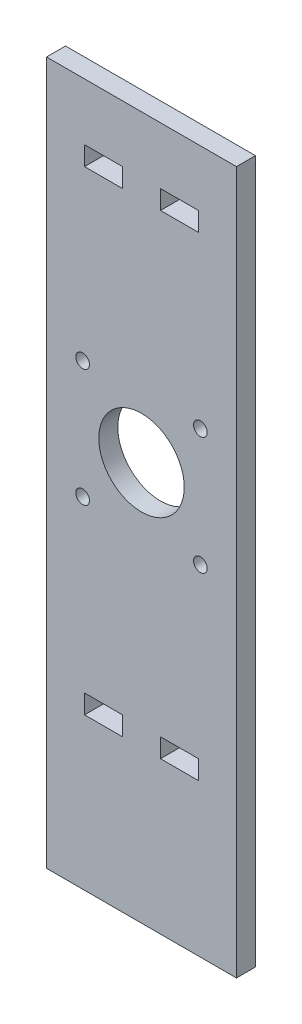
ISO-10303-21;
HEADER;
FILE_DESCRIPTION(('STEP AP214'),'2;1');
FILE_NAME('part.step','',(''),(''),'','','');
FILE_SCHEMA(('AUTOMOTIVE_DESIGN { 1 0 10303 214 1 1 1 1 }'));
ENDSEC;
DATA;
#1=APPLICATION_CONTEXT('core data for automotive mechanical design processes');
#2=APPLICATION_PROTOCOL_DEFINITION('international standard','automotive_design',2000,#1);
#3=PRODUCT_CONTEXT('',#1,'mechanical');
#4=PRODUCT('Part','Part','',(#3));
#5=PRODUCT_RELATED_PRODUCT_CATEGORY('part','',(#4));
#6=PRODUCT_DEFINITION_FORMATION('','',#4);
#7=PRODUCT_DEFINITION_CONTEXT('part definition',#1,'design');
#8=PRODUCT_DEFINITION('design','',#6,#7);
#9=PRODUCT_DEFINITION_SHAPE('','',#8);
#10=(LENGTH_UNIT() NAMED_UNIT(*) SI_UNIT(.MILLI.,.METRE.));
#11=(NAMED_UNIT(*) PLANE_ANGLE_UNIT() SI_UNIT($,.RADIAN.));
#12=(NAMED_UNIT(*) SI_UNIT($,.STERADIAN.) SOLID_ANGLE_UNIT());
#13=UNCERTAINTY_MEASURE_WITH_UNIT(LENGTH_MEASURE(1.E-05),#10,'distance_accuracy_value','');
#14=(GEOMETRIC_REPRESENTATION_CONTEXT(3) GLOBAL_UNCERTAINTY_ASSIGNED_CONTEXT((#13)) GLOBAL_UNIT_ASSIGNED_CONTEXT((#10,
#11,#12)) REPRESENTATION_CONTEXT('',''));
#15=CARTESIAN_POINT('',(0.,0.,0.));
#16=DIRECTION('',(0.,0.,1.));
#17=DIRECTION('',(1.,0.,0.));
#18=AXIS2_PLACEMENT_3D('',#15,#16,#17);
#19=CARTESIAN_POINT('',(0.,0.,5.));
#20=DIRECTION('',(0.,0.,-1.));
#21=DIRECTION('',(-1.,0.,0.));
#22=AXIS2_PLACEMENT_3D('',#19,#20,#21);
#23=PLANE('',#22);
#24=DIRECTION('',(-1.,0.,0.));
#25=VECTOR('',#24,1.);
#26=CARTESIAN_POINT('',(40.,45.,5.));
#27=LINE('',#26,#25);
#28=CARTESIAN_POINT('',(40.,45.,5.));
#29=VERTEX_POINT('',#28);
#30=CARTESIAN_POINT('',(30.,45.,5.));
#31=VERTEX_POINT('',#30);
#32=EDGE_CURVE('E209',#29,#31,#27,.T.);
#33=ORIENTED_EDGE('',*,*,#32,.F.);
#34=DIRECTION('',(0.,1.,0.));
#35=VECTOR('',#34,1.);
#36=CARTESIAN_POINT('',(40.,45.,5.));
#37=LINE('',#36,#35);
#38=CARTESIAN_POINT('',(40.,40.,5.));
#39=VERTEX_POINT('',#38);
#40=EDGE_CURVE('E217',#39,#29,#37,.T.);
#41=ORIENTED_EDGE('',*,*,#40,.F.);
#42=DIRECTION('',(1.,0.,0.));
#43=VECTOR('',#42,1.);
#44=CARTESIAN_POINT('',(40.,40.,5.));
#45=LINE('',#44,#43);
#46=CARTESIAN_POINT('',(30.,40.,5.));
#47=VERTEX_POINT('',#46);
#48=EDGE_CURVE('E214',#47,#39,#45,.T.);
#49=ORIENTED_EDGE('',*,*,#48,.F.);
#50=DIRECTION('',(0.,-1.,0.));
#51=VECTOR('',#50,1.);
#52=CARTESIAN_POINT('',(30.,45.,5.));
#53=LINE('',#52,#51);
#54=EDGE_CURVE('E211',#31,#47,#53,.T.);
#55=ORIENTED_EDGE('',*,*,#54,.F.);
#56=EDGE_LOOP('',(#33,#41,#49,#55));
#57=FACE_BOUND('',#56,.T.);
#58=DIRECTION('',(0.,-1.,0.));
#59=VECTOR('',#58,1.);
#60=CARTESIAN_POINT('',(10.,170.,5.));
#61=LINE('',#60,#59);
#62=CARTESIAN_POINT('',(10.,170.,5.));
#63=VERTEX_POINT('',#62);
#64=CARTESIAN_POINT('',(10.,165.,5.));
#65=VERTEX_POINT('',#64);
#66=EDGE_CURVE('E271',#63,#65,#61,.T.);
#67=ORIENTED_EDGE('',*,*,#66,.F.);
#68=DIRECTION('',(-1.,0.,0.));
#69=VECTOR('',#68,1.);
#70=CARTESIAN_POINT('',(10.,170.,5.));
#71=LINE('',#70,#69);
#72=CARTESIAN_POINT('',(20.,170.,5.));
#73=VERTEX_POINT('',#72);
#74=EDGE_CURVE('E279',#73,#63,#71,.T.);
#75=ORIENTED_EDGE('',*,*,#74,.F.);
#76=DIRECTION('',(0.,1.,0.));
#77=VECTOR('',#76,1.);
#78=CARTESIAN_POINT('',(20.,170.,5.));
#79=LINE('',#78,#77);
#80=CARTESIAN_POINT('',(20.,165.,5.));
#81=VERTEX_POINT('',#80);
#82=EDGE_CURVE('E276',#81,#73,#79,.T.);
#83=ORIENTED_EDGE('',*,*,#82,.F.);
#84=DIRECTION('',(1.,0.,0.));
#85=VECTOR('',#84,1.);
#86=CARTESIAN_POINT('',(10.,165.,5.));
#87=LINE('',#86,#85);
#88=EDGE_CURVE('E273',#65,#81,#87,.T.);
#89=ORIENTED_EDGE('',*,*,#88,.F.);
#90=EDGE_LOOP('',(#67,#75,#83,#89));
#91=FACE_BOUND('',#90,.T.);
#92=DIRECTION('',(0.,-1.,0.));
#93=VECTOR('',#92,1.);
#94=CARTESIAN_POINT('',(0.,0.,5.));
#95=LINE('',#94,#93);
#96=CARTESIAN_POINT('',(0.,185.,5.));
#97=VERTEX_POINT('',#96);
#98=CARTESIAN_POINT('',(0.,0.,5.));
#99=VERTEX_POINT('',#98);
#100=EDGE_CURVE('E302',#97,#99,#95,.T.);
#101=ORIENTED_EDGE('',*,*,#100,.T.);
#102=DIRECTION('',(1.,0.,0.));
#103=VECTOR('',#102,1.);
#104=CARTESIAN_POINT('',(0.,0.,5.));
#105=LINE('',#104,#103);
#106=CARTESIAN_POINT('',(50.,0.,5.));
#107=VERTEX_POINT('',#106);
#108=EDGE_CURVE('E305',#99,#107,#105,.T.);
#109=ORIENTED_EDGE('',*,*,#108,.T.);
#110=DIRECTION('',(0.,1.,0.));
#111=VECTOR('',#110,1.);
#112=CARTESIAN_POINT('',(50.,0.,5.));
#113=LINE('',#112,#111);
#114=CARTESIAN_POINT('',(50.,185.,5.));
#115=VERTEX_POINT('',#114);
#116=EDGE_CURVE('E308',#107,#115,#113,.T.);
#117=ORIENTED_EDGE('',*,*,#116,.T.);
#118=DIRECTION('',(-1.,0.,0.));
#119=VECTOR('',#118,1.);
#120=CARTESIAN_POINT('',(0.,185.,5.));
#121=LINE('',#120,#119);
#122=EDGE_CURVE('E310',#115,#97,#121,.T.);
#123=ORIENTED_EDGE('',*,*,#122,.T.);
#124=EDGE_LOOP('',(#101,#109,#117,#123));
#125=FACE_BOUND('',#124,.T.);
#126=DIRECTION('',(0.,-1.,0.));
#127=VECTOR('',#126,1.);
#128=CARTESIAN_POINT('',(10.,45.,5.));
#129=LINE('',#128,#127);
#130=CARTESIAN_POINT('',(10.,45.,5.));
#131=VERTEX_POINT('',#130);
#132=CARTESIAN_POINT('',(10.,40.,5.));
#133=VERTEX_POINT('',#132);
#134=EDGE_CURVE('E240',#131,#133,#129,.T.);
#135=ORIENTED_EDGE('',*,*,#134,.F.);
#136=DIRECTION('',(-1.,0.,0.));
#137=VECTOR('',#136,1.);
#138=CARTESIAN_POINT('',(10.,45.,5.));
#139=LINE('',#138,#137);
#140=CARTESIAN_POINT('',(20.,45.,5.));
#141=VERTEX_POINT('',#140);
#142=EDGE_CURVE('E248',#141,#131,#139,.T.);
#143=ORIENTED_EDGE('',*,*,#142,.F.);
#144=DIRECTION('',(0.,1.,0.));
#145=VECTOR('',#144,1.);
#146=CARTESIAN_POINT('',(20.,45.,5.));
#147=LINE('',#146,#145);
#148=CARTESIAN_POINT('',(20.,40.,5.));
#149=VERTEX_POINT('',#148);
#150=EDGE_CURVE('E245',#149,#141,#147,.T.);
#151=ORIENTED_EDGE('',*,*,#150,.F.);
#152=DIRECTION('',(1.,0.,0.));
#153=VECTOR('',#152,1.);
#154=CARTESIAN_POINT('',(10.,40.,5.));
#155=LINE('',#154,#153);
#156=EDGE_CURVE('E242',#133,#149,#155,.T.);
#157=ORIENTED_EDGE('',*,*,#156,.F.);
#158=EDGE_LOOP('',(#135,#143,#151,#157));
#159=FACE_BOUND('',#158,.T.);
#160=DIRECTION('',(-1.,0.,0.));
#161=VECTOR('',#160,1.);
#162=CARTESIAN_POINT('',(40.,170.,5.));
#163=LINE('',#162,#161);
#164=CARTESIAN_POINT('',(40.,170.,5.));
#165=VERTEX_POINT('',#164);
#166=CARTESIAN_POINT('',(30.,170.,5.));
#167=VERTEX_POINT('',#166);
#168=EDGE_CURVE('E170',#165,#167,#163,.T.);
#169=ORIENTED_EDGE('',*,*,#168,.F.);
#170=DIRECTION('',(0.,1.,0.));
#171=VECTOR('',#170,1.);
#172=CARTESIAN_POINT('',(40.,170.,5.));
#173=LINE('',#172,#171);
#174=CARTESIAN_POINT('',(40.,165.,5.));
#175=VERTEX_POINT('',#174);
#176=EDGE_CURVE('E193',#175,#165,#173,.T.);
#177=ORIENTED_EDGE('',*,*,#176,.F.);
#178=DIRECTION('',(1.,0.,0.));
#179=VECTOR('',#178,1.);
#180=CARTESIAN_POINT('',(40.,165.,5.));
#181=LINE('',#180,#179);
#182=CARTESIAN_POINT('',(30.,165.,5.));
#183=VERTEX_POINT('',#182);
#184=EDGE_CURVE('E191',#183,#175,#181,.T.);
#185=ORIENTED_EDGE('',*,*,#184,.F.);
#186=DIRECTION('',(0.,-1.,0.));
#187=VECTOR('',#186,1.);
#188=CARTESIAN_POINT('',(30.,170.,5.));
#189=LINE('',#188,#187);
#190=EDGE_CURVE('E178',#167,#183,#189,.T.);
#191=ORIENTED_EDGE('',*,*,#190,.F.);
#192=EDGE_LOOP('',(#169,#177,#185,#191));
#193=FACE_BOUND('',#192,.T.);
#194=CARTESIAN_POINT('',(25.,105.,5.));
#195=DIRECTION('',(0.,0.,1.));
#196=DIRECTION('',(1.,0.,0.));
#197=AXIS2_PLACEMENT_3D('',#194,#195,#196);
#198=CIRCLE('',#197,11.25);
#199=CARTESIAN_POINT('',(36.25,105.,5.));
#200=VERTEX_POINT('',#199);
#201=EDGE_CURVE('E199',#200,#200,#198,.T.);
#202=ORIENTED_EDGE('',*,*,#201,.F.);
#203=EDGE_LOOP('',(#202));
#204=FACE_BOUND('',#203,.T.);
#205=CARTESIAN_POINT('',(9.49999999999999,120.5,5.));
#206=DIRECTION('',(0.,0.,1.));
#207=DIRECTION('',(1.,0.,0.));
#208=AXIS2_PLACEMENT_3D('',#205,#206,#207);
#209=CIRCLE('',#208,1.8);
#210=CARTESIAN_POINT('',(11.3,120.5,5.));
#211=VERTEX_POINT('',#210);
#212=EDGE_CURVE('E486',#211,#211,#209,.T.);
#213=ORIENTED_EDGE('',*,*,#212,.F.);
#214=EDGE_LOOP('',(#213));
#215=FACE_BOUND('',#214,.T.);
#216=CARTESIAN_POINT('',(9.49999999999999,89.5,5.));
#217=DIRECTION('',(0.,0.,1.));
#218=DIRECTION('',(1.,0.,0.));
#219=AXIS2_PLACEMENT_3D('',#216,#217,#218);
#220=CIRCLE('',#219,1.8);
#221=CARTESIAN_POINT('',(11.3,89.5,5.));
#222=VERTEX_POINT('',#221);
#223=EDGE_CURVE('E480',#222,#222,#220,.T.);
#224=ORIENTED_EDGE('',*,*,#223,.F.);
#225=EDGE_LOOP('',(#224));
#226=FACE_BOUND('',#225,.T.);
#227=CARTESIAN_POINT('',(40.5,89.5,5.));
#228=DIRECTION('',(0.,0.,1.));
#229=DIRECTION('',(-1.,0.,0.));
#230=AXIS2_PLACEMENT_3D('',#227,#228,#229);
#231=CIRCLE('',#230,1.79999999999999);
#232=CARTESIAN_POINT('',(38.7,89.5,5.));
#233=VERTEX_POINT('',#232);
#234=EDGE_CURVE('E474',#233,#233,#231,.T.);
#235=ORIENTED_EDGE('',*,*,#234,.F.);
#236=EDGE_LOOP('',(#235));
#237=FACE_BOUND('',#236,.T.);
#238=CARTESIAN_POINT('',(40.5,120.5,5.));
#239=DIRECTION('',(0.,0.,1.));
#240=DIRECTION('',(-1.,0.,0.));
#241=AXIS2_PLACEMENT_3D('',#238,#239,#240);
#242=CIRCLE('',#241,1.79999999999999);
#243=CARTESIAN_POINT('',(38.7,120.5,5.));
#244=VERTEX_POINT('',#243);
#245=EDGE_CURVE('E465',#244,#244,#242,.T.);
#246=ORIENTED_EDGE('',*,*,#245,.F.);
#247=EDGE_LOOP('',(#246));
#248=FACE_BOUND('',#247,.T.);
#249=ADVANCED_FACE('F33',(#57,#91,#125,#159,#193,#204,#215,#226,#237,#248),#23,.F.);
#250=CARTESIAN_POINT('',(0.,0.,0.));
#251=DIRECTION('',(0.,0.,-1.));
#252=DIRECTION('',(-1.,0.,0.));
#253=AXIS2_PLACEMENT_3D('',#250,#251,#252);
#254=PLANE('',#253);
#255=CARTESIAN_POINT('',(40.5,89.5,0.));
#256=DIRECTION('',(0.,0.,1.));
#257=DIRECTION('',(-1.,0.,0.));
#258=AXIS2_PLACEMENT_3D('',#255,#256,#257);
#259=CIRCLE('',#258,1.79999999999999);
#260=CARTESIAN_POINT('',(38.7,89.5,0.));
#261=VERTEX_POINT('',#260);
#262=EDGE_CURVE('E471',#261,#261,#259,.T.);
#263=ORIENTED_EDGE('',*,*,#262,.T.);
#264=EDGE_LOOP('',(#263));
#265=FACE_BOUND('',#264,.T.);
#266=CARTESIAN_POINT('',(9.49999999999999,120.5,0.));
#267=DIRECTION('',(0.,0.,1.));
#268=DIRECTION('',(1.,0.,0.));
#269=AXIS2_PLACEMENT_3D('',#266,#267,#268);
#270=CIRCLE('',#269,1.8);
#271=CARTESIAN_POINT('',(11.3,120.5,0.));
#272=VERTEX_POINT('',#271);
#273=EDGE_CURVE('E483',#272,#272,#270,.T.);
#274=ORIENTED_EDGE('',*,*,#273,.T.);
#275=EDGE_LOOP('',(#274));
#276=FACE_BOUND('',#275,.T.);
#277=DIRECTION('',(0.,1.,0.));
#278=VECTOR('',#277,1.);
#279=CARTESIAN_POINT('',(40.,170.,0.));
#280=LINE('',#279,#278);
#281=CARTESIAN_POINT('',(40.,165.,0.));
#282=VERTEX_POINT('',#281);
#283=CARTESIAN_POINT('',(40.,170.,0.));
#284=VERTEX_POINT('',#283);
#285=EDGE_CURVE('E179',#282,#284,#280,.T.);
#286=ORIENTED_EDGE('',*,*,#285,.T.);
#287=DIRECTION('',(-1.,0.,0.));
#288=VECTOR('',#287,1.);
#289=CARTESIAN_POINT('',(40.,170.,0.));
#290=LINE('',#289,#288);
#291=CARTESIAN_POINT('',(30.,170.,0.));
#292=VERTEX_POINT('',#291);
#293=EDGE_CURVE('E56',#284,#292,#290,.T.);
#294=ORIENTED_EDGE('',*,*,#293,.T.);
#295=DIRECTION('',(0.,-1.,0.));
#296=VECTOR('',#295,1.);
#297=CARTESIAN_POINT('',(30.,170.,0.));
#298=LINE('',#297,#296);
#299=CARTESIAN_POINT('',(30.,165.,0.));
#300=VERTEX_POINT('',#299);
#301=EDGE_CURVE('E185',#292,#300,#298,.T.);
#302=ORIENTED_EDGE('',*,*,#301,.T.);
#303=DIRECTION('',(1.,0.,0.));
#304=VECTOR('',#303,1.);
#305=CARTESIAN_POINT('',(40.,165.,0.));
#306=LINE('',#305,#304);
#307=EDGE_CURVE('E201',#300,#282,#306,.T.);
#308=ORIENTED_EDGE('',*,*,#307,.T.);
#309=EDGE_LOOP('',(#286,#294,#302,#308));
#310=FACE_BOUND('',#309,.T.);
#311=DIRECTION('',(0.,1.,0.));
#312=VECTOR('',#311,1.);
#313=CARTESIAN_POINT('',(40.,45.,0.));
#314=LINE('',#313,#312);
#315=CARTESIAN_POINT('',(40.,40.,0.));
#316=VERTEX_POINT('',#315);
#317=CARTESIAN_POINT('',(40.,45.,0.));
#318=VERTEX_POINT('',#317);
#319=EDGE_CURVE('E212',#316,#318,#314,.T.);
#320=ORIENTED_EDGE('',*,*,#319,.T.);
#321=DIRECTION('',(-1.,0.,0.));
#322=VECTOR('',#321,1.);
#323=CARTESIAN_POINT('',(40.,45.,0.));
#324=LINE('',#323,#322);
#325=CARTESIAN_POINT('',(30.,45.,0.));
#326=VERTEX_POINT('',#325);
#327=EDGE_CURVE('E186',#318,#326,#324,.T.);
#328=ORIENTED_EDGE('',*,*,#327,.T.);
#329=DIRECTION('',(0.,-1.,0.));
#330=VECTOR('',#329,1.);
#331=CARTESIAN_POINT('',(30.,45.,0.));
#332=LINE('',#331,#330);
#333=CARTESIAN_POINT('',(30.,40.,0.));
#334=VERTEX_POINT('',#333);
#335=EDGE_CURVE('E222',#326,#334,#332,.T.);
#336=ORIENTED_EDGE('',*,*,#335,.T.);
#337=DIRECTION('',(1.,0.,0.));
#338=VECTOR('',#337,1.);
#339=CARTESIAN_POINT('',(40.,40.,0.));
#340=LINE('',#339,#338);
#341=EDGE_CURVE('E225',#334,#316,#340,.T.);
#342=ORIENTED_EDGE('',*,*,#341,.T.);
#343=EDGE_LOOP('',(#320,#328,#336,#342));
#344=FACE_BOUND('',#343,.T.);
#345=DIRECTION('',(-1.,0.,0.));
#346=VECTOR('',#345,1.);
#347=CARTESIAN_POINT('',(10.,45.,0.));
#348=LINE('',#347,#346);
#349=CARTESIAN_POINT('',(20.,45.,0.));
#350=VERTEX_POINT('',#349);
#351=CARTESIAN_POINT('',(10.,45.,0.));
#352=VERTEX_POINT('',#351);
#353=EDGE_CURVE('E243',#350,#352,#348,.T.);
#354=ORIENTED_EDGE('',*,*,#353,.T.);
#355=DIRECTION('',(0.,-1.,0.));
#356=VECTOR('',#355,1.);
#357=CARTESIAN_POINT('',(10.,45.,0.));
#358=LINE('',#357,#356);
#359=CARTESIAN_POINT('',(10.,40.,0.));
#360=VERTEX_POINT('',#359);
#361=EDGE_CURVE('E239',#352,#360,#358,.T.);
#362=ORIENTED_EDGE('',*,*,#361,.T.);
#363=DIRECTION('',(1.,0.,0.));
#364=VECTOR('',#363,1.);
#365=CARTESIAN_POINT('',(10.,40.,0.));
#366=LINE('',#365,#364);
#367=CARTESIAN_POINT('',(20.,40.,0.));
#368=VERTEX_POINT('',#367);
#369=EDGE_CURVE('E253',#360,#368,#366,.T.);
#370=ORIENTED_EDGE('',*,*,#369,.T.);
#371=DIRECTION('',(0.,1.,0.));
#372=VECTOR('',#371,1.);
#373=CARTESIAN_POINT('',(20.,45.,0.));
#374=LINE('',#373,#372);
#375=EDGE_CURVE('E256',#368,#350,#374,.T.);
#376=ORIENTED_EDGE('',*,*,#375,.T.);
#377=EDGE_LOOP('',(#354,#362,#370,#376));
#378=FACE_BOUND('',#377,.T.);
#379=DIRECTION('',(-1.,0.,0.));
#380=VECTOR('',#379,1.);
#381=CARTESIAN_POINT('',(10.,170.,0.));
#382=LINE('',#381,#380);
#383=CARTESIAN_POINT('',(20.,170.,0.));
#384=VERTEX_POINT('',#383);
#385=CARTESIAN_POINT('',(10.,170.,0.));
#386=VERTEX_POINT('',#385);
#387=EDGE_CURVE('E274',#384,#386,#382,.T.);
#388=ORIENTED_EDGE('',*,*,#387,.T.);
#389=DIRECTION('',(0.,-1.,0.));
#390=VECTOR('',#389,1.);
#391=CARTESIAN_POINT('',(10.,170.,0.));
#392=LINE('',#391,#390);
#393=CARTESIAN_POINT('',(10.,165.,0.));
#394=VERTEX_POINT('',#393);
#395=EDGE_CURVE('E270',#386,#394,#392,.T.);
#396=ORIENTED_EDGE('',*,*,#395,.T.);
#397=DIRECTION('',(1.,0.,0.));
#398=VECTOR('',#397,1.);
#399=CARTESIAN_POINT('',(10.,165.,0.));
#400=LINE('',#399,#398);
#401=CARTESIAN_POINT('',(20.,165.,0.));
#402=VERTEX_POINT('',#401);
#403=EDGE_CURVE('E284',#394,#402,#400,.T.);
#404=ORIENTED_EDGE('',*,*,#403,.T.);
#405=DIRECTION('',(0.,1.,0.));
#406=VECTOR('',#405,1.);
#407=CARTESIAN_POINT('',(20.,170.,0.));
#408=LINE('',#407,#406);
#409=EDGE_CURVE('E287',#402,#384,#408,.T.);
#410=ORIENTED_EDGE('',*,*,#409,.T.);
#411=EDGE_LOOP('',(#388,#396,#404,#410));
#412=FACE_BOUND('',#411,.T.);
#413=DIRECTION('',(0.,-1.,0.));
#414=VECTOR('',#413,1.);
#415=CARTESIAN_POINT('',(0.,0.,0.));
#416=LINE('',#415,#414);
#417=CARTESIAN_POINT('',(0.,185.,0.));
#418=VERTEX_POINT('',#417);
#419=CARTESIAN_POINT('',(0.,0.,0.));
#420=VERTEX_POINT('',#419);
#421=EDGE_CURVE('E301',#418,#420,#416,.T.);
#422=ORIENTED_EDGE('',*,*,#421,.F.);
#423=DIRECTION('',(-1.,0.,0.));
#424=VECTOR('',#423,1.);
#425=CARTESIAN_POINT('',(0.,185.,0.));
#426=LINE('',#425,#424);
#427=CARTESIAN_POINT('',(50.,185.,0.));
#428=VERTEX_POINT('',#427);
#429=EDGE_CURVE('E306',#428,#418,#426,.T.);
#430=ORIENTED_EDGE('',*,*,#429,.F.);
#431=DIRECTION('',(0.,1.,0.));
#432=VECTOR('',#431,1.);
#433=CARTESIAN_POINT('',(50.,0.,0.));
#434=LINE('',#433,#432);
#435=CARTESIAN_POINT('',(50.,0.,0.));
#436=VERTEX_POINT('',#435);
#437=EDGE_CURVE('E317',#436,#428,#434,.T.);
#438=ORIENTED_EDGE('',*,*,#437,.F.);
#439=DIRECTION('',(1.,0.,0.));
#440=VECTOR('',#439,1.);
#441=CARTESIAN_POINT('',(0.,0.,0.));
#442=LINE('',#441,#440);
#443=EDGE_CURVE('E315',#420,#436,#442,.T.);
#444=ORIENTED_EDGE('',*,*,#443,.F.);
#445=EDGE_LOOP('',(#422,#430,#438,#444));
#446=FACE_BOUND('',#445,.T.);
#447=CARTESIAN_POINT('',(25.,105.,0.));
#448=DIRECTION('',(0.,0.,1.));
#449=DIRECTION('',(1.,0.,0.));
#450=AXIS2_PLACEMENT_3D('',#447,#448,#449);
#451=CIRCLE('',#450,11.25);
#452=CARTESIAN_POINT('',(36.25,105.,0.));
#453=VERTEX_POINT('',#452);
#454=EDGE_CURVE('E489',#453,#453,#451,.T.);
#455=ORIENTED_EDGE('',*,*,#454,.T.);
#456=EDGE_LOOP('',(#455));
#457=FACE_BOUND('',#456,.T.);
#458=CARTESIAN_POINT('',(9.49999999999999,89.5,0.));
#459=DIRECTION('',(0.,0.,1.));
#460=DIRECTION('',(1.,0.,0.));
#461=AXIS2_PLACEMENT_3D('',#458,#459,#460);
#462=CIRCLE('',#461,1.8);
#463=CARTESIAN_POINT('',(11.3,89.5,0.));
#464=VERTEX_POINT('',#463);
#465=EDGE_CURVE('E477',#464,#464,#462,.T.);
#466=ORIENTED_EDGE('',*,*,#465,.T.);
#467=EDGE_LOOP('',(#466));
#468=FACE_BOUND('',#467,.T.);
#469=CARTESIAN_POINT('',(40.5,120.5,0.));
#470=DIRECTION('',(0.,0.,1.));
#471=DIRECTION('',(-1.,0.,0.));
#472=AXIS2_PLACEMENT_3D('',#469,#470,#471);
#473=CIRCLE('',#472,1.79999999999999);
#474=CARTESIAN_POINT('',(38.7,120.5,0.));
#475=VERTEX_POINT('',#474);
#476=EDGE_CURVE('E468',#475,#475,#473,.T.);
#477=ORIENTED_EDGE('',*,*,#476,.T.);
#478=EDGE_LOOP('',(#477));
#479=FACE_BOUND('',#478,.T.);
#480=ADVANCED_FACE('F335',(#265,#276,#310,#344,#378,#412,#446,#457,#468,#479),#254,.T.);
#481=CARTESIAN_POINT('',(0.,0.,5.));
#482=DIRECTION('',(1.,0.,0.));
#483=DIRECTION('',(0.,0.,-1.));
#484=AXIS2_PLACEMENT_3D('',#481,#482,#483);
#485=PLANE('',#484);
#486=ORIENTED_EDGE('',*,*,#421,.T.);
#487=DIRECTION('',(0.,0.,-1.));
#488=VECTOR('',#487,1.);
#489=CARTESIAN_POINT('',(0.,0.,5.));
#490=LINE('',#489,#488);
#491=EDGE_CURVE('E11',#99,#420,#490,.T.);
#492=ORIENTED_EDGE('',*,*,#491,.F.);
#493=ORIENTED_EDGE('',*,*,#100,.F.);
#494=DIRECTION('',(0.,0.,-1.));
#495=VECTOR('',#494,1.);
#496=CARTESIAN_POINT('',(0.,185.,5.));
#497=LINE('',#496,#495);
#498=EDGE_CURVE('E312',#97,#418,#497,.T.);
#499=ORIENTED_EDGE('',*,*,#498,.T.);
#500=EDGE_LOOP('',(#486,#492,#493,#499));
#501=FACE_BOUND('',#500,.T.);
#502=ADVANCED_FACE('F35',(#501),#485,.F.);
#503=CARTESIAN_POINT('',(0.,0.,5.));
#504=DIRECTION('',(0.,1.,0.));
#505=DIRECTION('',(0.,0.,1.));
#506=AXIS2_PLACEMENT_3D('',#503,#504,#505);
#507=PLANE('',#506);
#508=ORIENTED_EDGE('',*,*,#443,.T.);
#509=DIRECTION('',(0.,0.,-1.));
#510=VECTOR('',#509,1.);
#511=CARTESIAN_POINT('',(50.,0.,5.));
#512=LINE('',#511,#510);
#513=EDGE_CURVE('E41',#107,#436,#512,.T.);
#514=ORIENTED_EDGE('',*,*,#513,.F.);
#515=ORIENTED_EDGE('',*,*,#108,.F.);
#516=ORIENTED_EDGE('',*,*,#491,.T.);
#517=EDGE_LOOP('',(#508,#514,#515,#516));
#518=FACE_BOUND('',#517,.T.);
#519=ADVANCED_FACE('F346',(#518),#507,.F.);
#520=CARTESIAN_POINT('',(50.,0.,5.));
#521=DIRECTION('',(-1.,0.,0.));
#522=DIRECTION('',(0.,-1.,0.));
#523=AXIS2_PLACEMENT_3D('',#520,#521,#522);
#524=PLANE('',#523);
#525=ORIENTED_EDGE('',*,*,#437,.T.);
#526=DIRECTION('',(0.,0.,-1.));
#527=VECTOR('',#526,1.);
#528=CARTESIAN_POINT('',(50.,185.,5.));
#529=LINE('',#528,#527);
#530=EDGE_CURVE('E322',#115,#428,#529,.T.);
#531=ORIENTED_EDGE('',*,*,#530,.F.);
#532=ORIENTED_EDGE('',*,*,#116,.F.);
#533=ORIENTED_EDGE('',*,*,#513,.T.);
#534=EDGE_LOOP('',(#525,#531,#532,#533));
#535=FACE_BOUND('',#534,.T.);
#536=ADVANCED_FACE('F329',(#535),#524,.F.);
#537=CARTESIAN_POINT('',(0.,185.,5.));
#538=DIRECTION('',(0.,-1.,0.));
#539=DIRECTION('',(0.,0.,-1.));
#540=AXIS2_PLACEMENT_3D('',#537,#538,#539);
#541=PLANE('',#540);
#542=ORIENTED_EDGE('',*,*,#429,.T.);
#543=ORIENTED_EDGE('',*,*,#498,.F.);
#544=ORIENTED_EDGE('',*,*,#122,.F.);
#545=ORIENTED_EDGE('',*,*,#530,.T.);
#546=EDGE_LOOP('',(#542,#543,#544,#545));
#547=FACE_BOUND('',#546,.T.);
#548=ADVANCED_FACE('F339',(#547),#541,.F.);
#549=CARTESIAN_POINT('',(10.,170.,5.));
#550=DIRECTION('',(1.,0.,0.));
#551=DIRECTION('',(0.,1.,0.));
#552=AXIS2_PLACEMENT_3D('',#549,#550,#551);
#553=PLANE('',#552);
#554=ORIENTED_EDGE('',*,*,#395,.F.);
#555=DIRECTION('',(0.,0.,-1.));
#556=VECTOR('',#555,1.);
#557=CARTESIAN_POINT('',(10.,170.,5.));
#558=LINE('',#557,#556);
#559=EDGE_CURVE('E281',#63,#386,#558,.T.);
#560=ORIENTED_EDGE('',*,*,#559,.F.);
#561=ORIENTED_EDGE('',*,*,#66,.T.);
#562=DIRECTION('',(0.,0.,-1.));
#563=VECTOR('',#562,1.);
#564=CARTESIAN_POINT('',(10.,165.,5.));
#565=LINE('',#564,#563);
#566=EDGE_CURVE('E298',#65,#394,#565,.T.);
#567=ORIENTED_EDGE('',*,*,#566,.T.);
#568=EDGE_LOOP('',(#554,#560,#561,#567));
#569=FACE_BOUND('',#568,.T.);
#570=ADVANCED_FACE('F364',(#569),#553,.T.);
#571=CARTESIAN_POINT('',(10.,165.,5.));
#572=DIRECTION('',(0.,1.,0.));
#573=DIRECTION('',(0.,0.,1.));
#574=AXIS2_PLACEMENT_3D('',#571,#572,#573);
#575=PLANE('',#574);
#576=ORIENTED_EDGE('',*,*,#403,.F.);
#577=ORIENTED_EDGE('',*,*,#566,.F.);
#578=ORIENTED_EDGE('',*,*,#88,.T.);
#579=DIRECTION('',(0.,0.,-1.));
#580=VECTOR('',#579,1.);
#581=CARTESIAN_POINT('',(20.,165.,5.));
#582=LINE('',#581,#580);
#583=EDGE_CURVE('E296',#81,#402,#582,.T.);
#584=ORIENTED_EDGE('',*,*,#583,.T.);
#585=EDGE_LOOP('',(#576,#577,#578,#584));
#586=FACE_BOUND('',#585,.T.);
#587=ADVANCED_FACE('F371',(#586),#575,.T.);
#588=CARTESIAN_POINT('',(20.,170.,5.));
#589=DIRECTION('',(-1.,0.,0.));
#590=DIRECTION('',(0.,0.,1.));
#591=AXIS2_PLACEMENT_3D('',#588,#589,#590);
#592=PLANE('',#591);
#593=ORIENTED_EDGE('',*,*,#409,.F.);
#594=ORIENTED_EDGE('',*,*,#583,.F.);
#595=ORIENTED_EDGE('',*,*,#82,.T.);
#596=DIRECTION('',(0.,0.,-1.));
#597=VECTOR('',#596,1.);
#598=CARTESIAN_POINT('',(20.,170.,5.));
#599=LINE('',#598,#597);
#600=EDGE_CURVE('E294',#73,#384,#599,.T.);
#601=ORIENTED_EDGE('',*,*,#600,.T.);
#602=EDGE_LOOP('',(#593,#594,#595,#601));
#603=FACE_BOUND('',#602,.T.);
#604=ADVANCED_FACE('F376',(#603),#592,.T.);
#605=CARTESIAN_POINT('',(10.,170.,5.));
#606=DIRECTION('',(0.,-1.,0.));
#607=DIRECTION('',(0.,0.,-1.));
#608=AXIS2_PLACEMENT_3D('',#605,#606,#607);
#609=PLANE('',#608);
#610=ORIENTED_EDGE('',*,*,#387,.F.);
#611=ORIENTED_EDGE('',*,*,#600,.F.);
#612=ORIENTED_EDGE('',*,*,#74,.T.);
#613=ORIENTED_EDGE('',*,*,#559,.T.);
#614=EDGE_LOOP('',(#610,#611,#612,#613));
#615=FACE_BOUND('',#614,.T.);
#616=ADVANCED_FACE('F384',(#615),#609,.T.);
#617=CARTESIAN_POINT('',(10.,45.,5.));
#618=DIRECTION('',(1.,0.,0.));
#619=DIRECTION('',(0.,1.,0.));
#620=AXIS2_PLACEMENT_3D('',#617,#618,#619);
#621=PLANE('',#620);
#622=ORIENTED_EDGE('',*,*,#361,.F.);
#623=DIRECTION('',(0.,0.,-1.));
#624=VECTOR('',#623,1.);
#625=CARTESIAN_POINT('',(10.,45.,5.));
#626=LINE('',#625,#624);
#627=EDGE_CURVE('E250',#131,#352,#626,.T.);
#628=ORIENTED_EDGE('',*,*,#627,.F.);
#629=ORIENTED_EDGE('',*,*,#134,.T.);
#630=DIRECTION('',(0.,0.,-1.));
#631=VECTOR('',#630,1.);
#632=CARTESIAN_POINT('',(10.,40.,5.));
#633=LINE('',#632,#631);
#634=EDGE_CURVE('E267',#133,#360,#633,.T.);
#635=ORIENTED_EDGE('',*,*,#634,.T.);
#636=EDGE_LOOP('',(#622,#628,#629,#635));
#637=FACE_BOUND('',#636,.T.);
#638=ADVANCED_FACE('F396',(#637),#621,.T.);
#639=CARTESIAN_POINT('',(10.,40.,5.));
#640=DIRECTION('',(0.,1.,0.));
#641=DIRECTION('',(0.,0.,1.));
#642=AXIS2_PLACEMENT_3D('',#639,#640,#641);
#643=PLANE('',#642);
#644=ORIENTED_EDGE('',*,*,#369,.F.);
#645=ORIENTED_EDGE('',*,*,#634,.F.);
#646=ORIENTED_EDGE('',*,*,#156,.T.);
#647=DIRECTION('',(0.,0.,-1.));
#648=VECTOR('',#647,1.);
#649=CARTESIAN_POINT('',(20.,40.,5.));
#650=LINE('',#649,#648);
#651=EDGE_CURVE('E265',#149,#368,#650,.T.);
#652=ORIENTED_EDGE('',*,*,#651,.T.);
#653=EDGE_LOOP('',(#644,#645,#646,#652));
#654=FACE_BOUND('',#653,.T.);
#655=ADVANCED_FACE('F401',(#654),#643,.T.);
#656=CARTESIAN_POINT('',(20.,45.,5.));
#657=DIRECTION('',(-1.,0.,0.));
#658=DIRECTION('',(0.,0.,1.));
#659=AXIS2_PLACEMENT_3D('',#656,#657,#658);
#660=PLANE('',#659);
#661=ORIENTED_EDGE('',*,*,#375,.F.);
#662=ORIENTED_EDGE('',*,*,#651,.F.);
#663=ORIENTED_EDGE('',*,*,#150,.T.);
#664=DIRECTION('',(0.,0.,-1.));
#665=VECTOR('',#664,1.);
#666=CARTESIAN_POINT('',(20.,45.,5.));
#667=LINE('',#666,#665);
#668=EDGE_CURVE('E263',#141,#350,#667,.T.);
#669=ORIENTED_EDGE('',*,*,#668,.T.);
#670=EDGE_LOOP('',(#661,#662,#663,#669));
#671=FACE_BOUND('',#670,.T.);
#672=ADVANCED_FACE('F405',(#671),#660,.T.);
#673=CARTESIAN_POINT('',(10.,45.,5.));
#674=DIRECTION('',(0.,-1.,0.));
#675=DIRECTION('',(1.,0.,0.));
#676=AXIS2_PLACEMENT_3D('',#673,#674,#675);
#677=PLANE('',#676);
#678=ORIENTED_EDGE('',*,*,#353,.F.);
#679=ORIENTED_EDGE('',*,*,#668,.F.);
#680=ORIENTED_EDGE('',*,*,#142,.T.);
#681=ORIENTED_EDGE('',*,*,#627,.T.);
#682=EDGE_LOOP('',(#678,#679,#680,#681));
#683=FACE_BOUND('',#682,.T.);
#684=ADVANCED_FACE('F409',(#683),#677,.T.);
#685=CARTESIAN_POINT('',(40.,45.,5.));
#686=DIRECTION('',(0.,-1.,0.));
#687=DIRECTION('',(0.,0.,-1.));
#688=AXIS2_PLACEMENT_3D('',#685,#686,#687);
#689=PLANE('',#688);
#690=ORIENTED_EDGE('',*,*,#327,.F.);
#691=DIRECTION('',(0.,0.,-1.));
#692=VECTOR('',#691,1.);
#693=CARTESIAN_POINT('',(40.,45.,5.));
#694=LINE('',#693,#692);
#695=EDGE_CURVE('E219',#29,#318,#694,.T.);
#696=ORIENTED_EDGE('',*,*,#695,.F.);
#697=ORIENTED_EDGE('',*,*,#32,.T.);
#698=DIRECTION('',(0.,0.,-1.));
#699=VECTOR('',#698,1.);
#700=CARTESIAN_POINT('',(30.,45.,5.));
#701=LINE('',#700,#699);
#702=EDGE_CURVE('E236',#31,#326,#701,.T.);
#703=ORIENTED_EDGE('',*,*,#702,.T.);
#704=EDGE_LOOP('',(#690,#696,#697,#703));
#705=FACE_BOUND('',#704,.T.);
#706=ADVANCED_FACE('F413',(#705),#689,.T.);
#707=CARTESIAN_POINT('',(30.,45.,5.));
#708=DIRECTION('',(1.,0.,0.));
#709=DIRECTION('',(0.,0.,-1.));
#710=AXIS2_PLACEMENT_3D('',#707,#708,#709);
#711=PLANE('',#710);
#712=ORIENTED_EDGE('',*,*,#335,.F.);
#713=ORIENTED_EDGE('',*,*,#702,.F.);
#714=ORIENTED_EDGE('',*,*,#54,.T.);
#715=DIRECTION('',(0.,0.,-1.));
#716=VECTOR('',#715,1.);
#717=CARTESIAN_POINT('',(30.,40.,5.));
#718=LINE('',#717,#716);
#719=EDGE_CURVE('E234',#47,#334,#718,.T.);
#720=ORIENTED_EDGE('',*,*,#719,.T.);
#721=EDGE_LOOP('',(#712,#713,#714,#720));
#722=FACE_BOUND('',#721,.T.);
#723=ADVANCED_FACE('F417',(#722),#711,.T.);
#724=CARTESIAN_POINT('',(40.,40.,5.));
#725=DIRECTION('',(0.,1.,0.));
#726=DIRECTION('',(-1.,0.,0.));
#727=AXIS2_PLACEMENT_3D('',#724,#725,#726);
#728=PLANE('',#727);
#729=ORIENTED_EDGE('',*,*,#341,.F.);
#730=ORIENTED_EDGE('',*,*,#719,.F.);
#731=ORIENTED_EDGE('',*,*,#48,.T.);
#732=DIRECTION('',(0.,0.,-1.));
#733=VECTOR('',#732,1.);
#734=CARTESIAN_POINT('',(40.,40.,5.));
#735=LINE('',#734,#733);
#736=EDGE_CURVE('E232',#39,#316,#735,.T.);
#737=ORIENTED_EDGE('',*,*,#736,.T.);
#738=EDGE_LOOP('',(#729,#730,#731,#737));
#739=FACE_BOUND('',#738,.T.);
#740=ADVANCED_FACE('F421',(#739),#728,.T.);
#741=CARTESIAN_POINT('',(40.,45.,5.));
#742=DIRECTION('',(-1.,0.,0.));
#743=DIRECTION('',(0.,0.,1.));
#744=AXIS2_PLACEMENT_3D('',#741,#742,#743);
#745=PLANE('',#744);
#746=ORIENTED_EDGE('',*,*,#319,.F.);
#747=ORIENTED_EDGE('',*,*,#736,.F.);
#748=ORIENTED_EDGE('',*,*,#40,.T.);
#749=ORIENTED_EDGE('',*,*,#695,.T.);
#750=EDGE_LOOP('',(#746,#747,#748,#749));
#751=FACE_BOUND('',#750,.T.);
#752=ADVANCED_FACE('F425',(#751),#745,.T.);
#753=CARTESIAN_POINT('',(40.,170.,5.));
#754=DIRECTION('',(0.,-1.,0.));
#755=DIRECTION('',(0.,0.,-1.));
#756=AXIS2_PLACEMENT_3D('',#753,#754,#755);
#757=PLANE('',#756);
#758=ORIENTED_EDGE('',*,*,#293,.F.);
#759=DIRECTION('',(0.,0.,-1.));
#760=VECTOR('',#759,1.);
#761=CARTESIAN_POINT('',(40.,170.,5.));
#762=LINE('',#761,#760);
#763=EDGE_CURVE('E174',#165,#284,#762,.T.);
#764=ORIENTED_EDGE('',*,*,#763,.F.);
#765=ORIENTED_EDGE('',*,*,#168,.T.);
#766=DIRECTION('',(0.,0.,-1.));
#767=VECTOR('',#766,1.);
#768=CARTESIAN_POINT('',(30.,170.,5.));
#769=LINE('',#768,#767);
#770=EDGE_CURVE('E173',#167,#292,#769,.T.);
#771=ORIENTED_EDGE('',*,*,#770,.T.);
#772=EDGE_LOOP('',(#758,#764,#765,#771));
#773=FACE_BOUND('',#772,.T.);
#774=ADVANCED_FACE('F172',(#773),#757,.T.);
#775=CARTESIAN_POINT('',(30.,170.,5.));
#776=DIRECTION('',(1.,0.,0.));
#777=DIRECTION('',(0.,0.,-1.));
#778=AXIS2_PLACEMENT_3D('',#775,#776,#777);
#779=PLANE('',#778);
#780=ORIENTED_EDGE('',*,*,#301,.F.);
#781=ORIENTED_EDGE('',*,*,#770,.F.);
#782=ORIENTED_EDGE('',*,*,#190,.T.);
#783=DIRECTION('',(0.,0.,-1.));
#784=VECTOR('',#783,1.);
#785=CARTESIAN_POINT('',(30.,165.,5.));
#786=LINE('',#785,#784);
#787=EDGE_CURVE('E187',#183,#300,#786,.T.);
#788=ORIENTED_EDGE('',*,*,#787,.T.);
#789=EDGE_LOOP('',(#780,#781,#782,#788));
#790=FACE_BOUND('',#789,.T.);
#791=ADVANCED_FACE('F182',(#790),#779,.T.);
#792=CARTESIAN_POINT('',(40.,165.,5.));
#793=DIRECTION('',(0.,1.,0.));
#794=DIRECTION('',(0.,0.,1.));
#795=AXIS2_PLACEMENT_3D('',#792,#793,#794);
#796=PLANE('',#795);
#797=ORIENTED_EDGE('',*,*,#307,.F.);
#798=ORIENTED_EDGE('',*,*,#787,.F.);
#799=ORIENTED_EDGE('',*,*,#184,.T.);
#800=DIRECTION('',(0.,0.,-1.));
#801=VECTOR('',#800,1.);
#802=CARTESIAN_POINT('',(40.,165.,5.));
#803=LINE('',#802,#801);
#804=EDGE_CURVE('E48',#175,#282,#803,.T.);
#805=ORIENTED_EDGE('',*,*,#804,.T.);
#806=EDGE_LOOP('',(#797,#798,#799,#805));
#807=FACE_BOUND('',#806,.T.);
#808=ADVANCED_FACE('F434',(#807),#796,.T.);
#809=CARTESIAN_POINT('',(40.,170.,5.));
#810=DIRECTION('',(-1.,0.,0.));
#811=DIRECTION('',(0.,0.,1.));
#812=AXIS2_PLACEMENT_3D('',#809,#810,#811);
#813=PLANE('',#812);
#814=ORIENTED_EDGE('',*,*,#285,.F.);
#815=ORIENTED_EDGE('',*,*,#804,.F.);
#816=ORIENTED_EDGE('',*,*,#176,.T.);
#817=ORIENTED_EDGE('',*,*,#763,.T.);
#818=EDGE_LOOP('',(#814,#815,#816,#817));
#819=FACE_BOUND('',#818,.T.);
#820=ADVANCED_FACE('F437',(#819),#813,.T.);
#821=CARTESIAN_POINT('',(25.,105.,5.));
#822=DIRECTION('',(0.,0.,-1.));
#823=DIRECTION('',(-1.,0.,0.));
#824=AXIS2_PLACEMENT_3D('',#821,#822,#823);
#825=CYLINDRICAL_SURFACE('',#824,11.25);
#826=ORIENTED_EDGE('',*,*,#201,.T.);
#827=EDGE_LOOP('',(#826));
#828=FACE_BOUND('',#827,.T.);
#829=ORIENTED_EDGE('',*,*,#454,.F.);
#830=EDGE_LOOP('',(#829));
#831=FACE_BOUND('',#830,.T.);
#832=ADVANCED_FACE('F441',(#828,#831),#825,.F.);
#833=CARTESIAN_POINT('',(9.49999999999999,120.5,5.));
#834=DIRECTION('',(0.,0.,-1.));
#835=DIRECTION('',(-1.,0.,0.));
#836=AXIS2_PLACEMENT_3D('',#833,#834,#835);
#837=CYLINDRICAL_SURFACE('',#836,1.8);
#838=ORIENTED_EDGE('',*,*,#212,.T.);
#839=EDGE_LOOP('',(#838));
#840=FACE_BOUND('',#839,.T.);
#841=ORIENTED_EDGE('',*,*,#273,.F.);
#842=EDGE_LOOP('',(#841));
#843=FACE_BOUND('',#842,.T.);
#844=ADVANCED_FACE('F444',(#840,#843),#837,.F.);
#845=CARTESIAN_POINT('',(9.49999999999999,89.5,5.));
#846=DIRECTION('',(0.,0.,-1.));
#847=DIRECTION('',(-1.,0.,0.));
#848=AXIS2_PLACEMENT_3D('',#845,#846,#847);
#849=CYLINDRICAL_SURFACE('',#848,1.8);
#850=ORIENTED_EDGE('',*,*,#223,.T.);
#851=EDGE_LOOP('',(#850));
#852=FACE_BOUND('',#851,.T.);
#853=ORIENTED_EDGE('',*,*,#465,.F.);
#854=EDGE_LOOP('',(#853));
#855=FACE_BOUND('',#854,.T.);
#856=ADVANCED_FACE('F448',(#852,#855),#849,.F.);
#857=CARTESIAN_POINT('',(40.5,89.5,5.));
#858=DIRECTION('',(0.,0.,-1.));
#859=DIRECTION('',(-1.,0.,0.));
#860=AXIS2_PLACEMENT_3D('',#857,#858,#859);
#861=CYLINDRICAL_SURFACE('',#860,1.79999999999999);
#862=ORIENTED_EDGE('',*,*,#234,.T.);
#863=EDGE_LOOP('',(#862));
#864=FACE_BOUND('',#863,.T.);
#865=ORIENTED_EDGE('',*,*,#262,.F.);
#866=EDGE_LOOP('',(#865));
#867=FACE_BOUND('',#866,.T.);
#868=ADVANCED_FACE('F452',(#864,#867),#861,.F.);
#869=CARTESIAN_POINT('',(40.5,120.5,5.));
#870=DIRECTION('',(0.,0.,-1.));
#871=DIRECTION('',(-1.,0.,0.));
#872=AXIS2_PLACEMENT_3D('',#869,#870,#871);
#873=CYLINDRICAL_SURFACE('',#872,1.79999999999999);
#874=ORIENTED_EDGE('',*,*,#245,.T.);
#875=EDGE_LOOP('',(#874));
#876=FACE_BOUND('',#875,.T.);
#877=ORIENTED_EDGE('',*,*,#476,.F.);
#878=EDGE_LOOP('',(#877));
#879=FACE_BOUND('',#878,.T.);
#880=ADVANCED_FACE('F456',(#876,#879),#873,.F.);
#881=CLOSED_SHELL('',(#249,#480,#502,#519,#536,#548,#570,#587,#604,#616,#638,#655,#672,#684,
#706,#723,#740,#752,#774,#791,#808,#820,#832,#844,#856,#868,#880));
#882=MANIFOLD_SOLID_BREP('B2',#881);
#883=ADVANCED_BREP_SHAPE_REPRESENTATION('',(#18,#882),#14);
#884=SHAPE_DEFINITION_REPRESENTATION(#9,#883);
ENDSEC;
END-ISO-10303-21;
